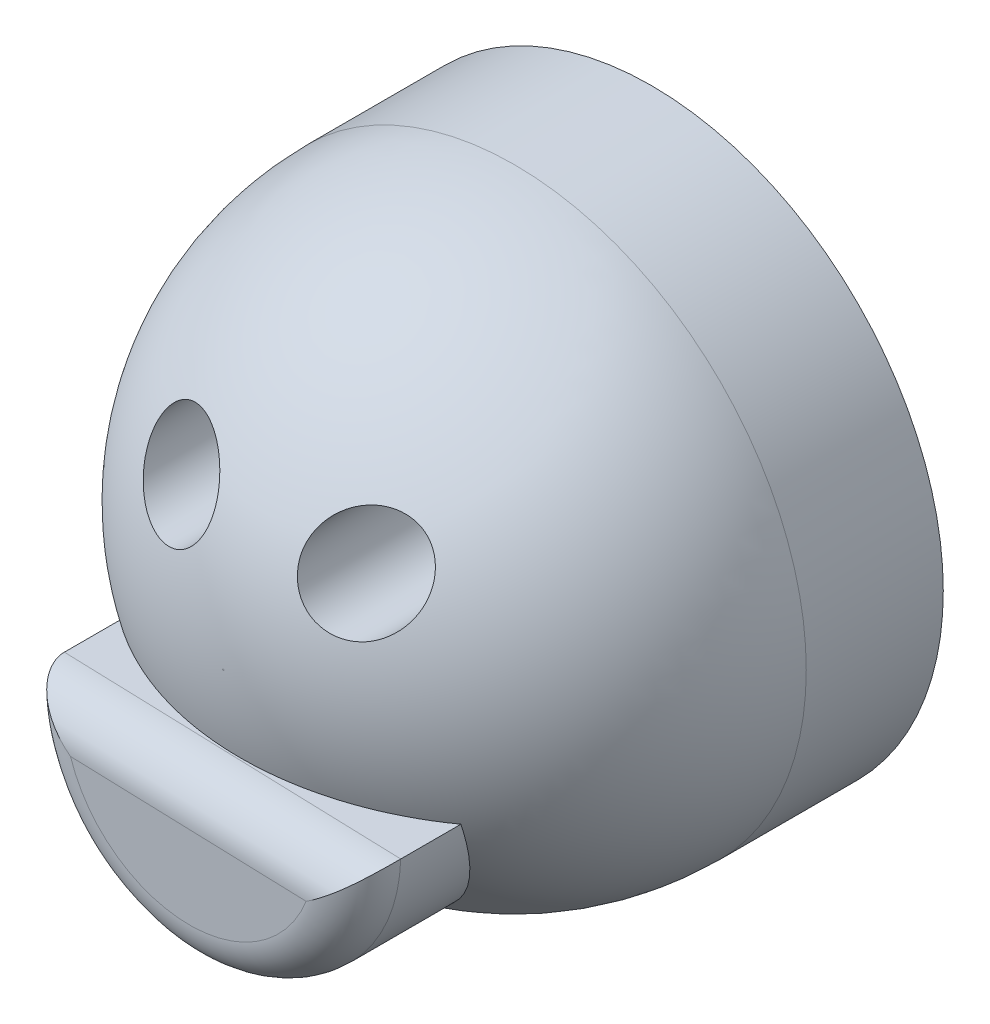
ISO-10303-21;
HEADER;
FILE_DESCRIPTION(('STEP AP214'),'2;1');
FILE_NAME('part.step','',(''),(''),'','','');
FILE_SCHEMA(('AUTOMOTIVE_DESIGN { 1 0 10303 214 1 1 1 1 }'));
ENDSEC;
DATA;
#1=APPLICATION_CONTEXT('core data for automotive mechanical design processes');
#2=APPLICATION_PROTOCOL_DEFINITION('international standard','automotive_design',2000,#1);
#3=PRODUCT_CONTEXT('',#1,'mechanical');
#4=PRODUCT('Part','Part','',(#3));
#5=PRODUCT_RELATED_PRODUCT_CATEGORY('part','',(#4));
#6=PRODUCT_DEFINITION_FORMATION('','',#4);
#7=PRODUCT_DEFINITION_CONTEXT('part definition',#1,'design');
#8=PRODUCT_DEFINITION('design','',#6,#7);
#9=PRODUCT_DEFINITION_SHAPE('','',#8);
#10=(LENGTH_UNIT() NAMED_UNIT(*) SI_UNIT(.MILLI.,.METRE.));
#11=(NAMED_UNIT(*) PLANE_ANGLE_UNIT() SI_UNIT($,.RADIAN.));
#12=(NAMED_UNIT(*) SI_UNIT($,.STERADIAN.) SOLID_ANGLE_UNIT());
#13=UNCERTAINTY_MEASURE_WITH_UNIT(LENGTH_MEASURE(1.E-05),#10,'distance_accuracy_value','');
#14=(GEOMETRIC_REPRESENTATION_CONTEXT(3) GLOBAL_UNCERTAINTY_ASSIGNED_CONTEXT((#13)) GLOBAL_UNIT_ASSIGNED_CONTEXT((#10,
#11,#12)) REPRESENTATION_CONTEXT('',''));
#15=CARTESIAN_POINT('',(0.,0.,0.));
#16=DIRECTION('',(0.,0.,1.));
#17=DIRECTION('',(1.,0.,0.));
#18=AXIS2_PLACEMENT_3D('',#15,#16,#17);
#19=CARTESIAN_POINT('',(-9.25737723848741,12.8505214496792,57.));
#20=DIRECTION('',(0.,0.,-1.));
#21=DIRECTION('',(-1.,0.,0.));
#22=AXIS2_PLACEMENT_3D('',#19,#20,#21);
#23=CYLINDRICAL_SURFACE('',#22,5.5);
#24=CARTESIAN_POINT('',(-12.9072072028845,16.9649766057103,42.5477959091102));
#25=CARTESIAN_POINT('',(-13.0140604511853,16.8701891517838,42.5563873106308));
#26=CARTESIAN_POINT('',(-13.1170758880721,16.7713597964741,42.5682582121675));
#27=CARTESIAN_POINT('',(-13.3147178261177,16.5664684033086,42.5983704048194));
#28=CARTESIAN_POINT('',(-13.4093404121222,16.4604030303369,42.6166146496213));
#29=CARTESIAN_POINT('',(-13.5897015599936,16.2418444617009,42.6592190220472));
#30=CARTESIAN_POINT('',(-13.6754258679522,16.1293413875084,42.6835887546428));
#31=CARTESIAN_POINT('',(-13.8374136016537,15.898981059377,42.7380789757917));
#32=CARTESIAN_POINT('',(-13.9136730116155,15.7811215615834,42.7682018916464));
#33=CARTESIAN_POINT('',(-14.0560204152741,15.5416764065529,42.8336078836441));
#34=CARTESIAN_POINT('',(-14.1221600944632,15.4201137656634,42.8688628121162));
#35=CARTESIAN_POINT('',(-14.2446054670298,15.1735641710642,42.9442145829014));
#36=CARTESIAN_POINT('',(-14.3009074657991,15.0485759511539,42.9843132347869));
#37=CARTESIAN_POINT('',(-14.454857651207,14.6699422650967,43.1111506170001));
#38=CARTESIAN_POINT('',(-14.5377154121831,14.4123463553259,43.2045085848092));
#39=CARTESIAN_POINT('',(-14.6691007064146,13.8733152917599,43.4128768338721));
#40=CARTESIAN_POINT('',(-14.7145081868092,13.5915669035247,43.5289985520606));
#41=CARTESIAN_POINT('',(-14.7616881300874,13.0296894637786,43.7734021902099));
#42=CARTESIAN_POINT('',(-14.7634390483365,12.7495612800146,43.9016900828656));
#43=CARTESIAN_POINT('',(-14.7227768183386,12.1587353695515,44.1848382866665));
#44=CARTESIAN_POINT('',(-14.6743397812629,11.8490463305635,44.340942380525));
#45=CARTESIAN_POINT('',(-14.5271092923104,11.2453591427245,44.6596744689687));
#46=CARTESIAN_POINT('',(-14.4282896900209,10.9513692299288,44.8223058110116));
#47=CARTESIAN_POINT('',(-14.1710647026199,10.3562882313705,45.1668199242544));
#48=CARTESIAN_POINT('',(-14.0076098553691,10.0575312709706,45.3489743842794));
#49=CARTESIAN_POINT('',(-13.6277670948659,9.49418275185944,45.7115846485517));
#50=CARTESIAN_POINT('',(-13.4113626307013,9.22960191545685,45.8920399033129));
#51=CARTESIAN_POINT('',(-13.0475652668029,8.8610915053749,46.1602677255554));
#52=CARTESIAN_POINT('',(-12.9175600985739,8.7414511789301,46.2505703404357));
#53=CARTESIAN_POINT('',(-12.6456794842515,8.51454241653131,46.4287643814814));
#54=CARTESIAN_POINT('',(-12.5038090474399,8.40726880463527,46.5166568045789));
#55=CARTESIAN_POINT('',(-12.2089926362081,8.20618856060068,46.6893998287366));
#56=CARTESIAN_POINT('',(-12.0560421432269,8.11238746973621,46.7742491674661));
#57=CARTESIAN_POINT('',(-11.7401840827872,7.93950747853151,46.9401333329919));
#58=CARTESIAN_POINT('',(-11.5772818564354,7.86042077158814,47.021170165335));
#59=CARTESIAN_POINT('',(-11.2514307253294,7.72183480327307,47.1745912012373));
#60=CARTESIAN_POINT('',(-11.0889361714544,7.66152328058421,47.2472063320046));
#61=CARTESIAN_POINT('',(-10.7572046364165,7.55611057745018,47.3877233113489));
#62=CARTESIAN_POINT('',(-10.5879711922357,7.51100153246962,47.455627582461));
#63=CARTESIAN_POINT('',(-10.2440510656069,7.4368897342342,47.5860801427284));
#64=CARTESIAN_POINT('',(-10.0693661430575,7.40788183871743,47.6486301364878));
#65=CARTESIAN_POINT('',(-9.71600008185808,7.36679177396061,47.767722236032));
#66=CARTESIAN_POINT('',(-9.5373194733823,7.3547073725788,47.8242651332197));
#67=CARTESIAN_POINT('',(-9.1969369148355,7.34850898638994,47.9249739543726));
#68=CARTESIAN_POINT('',(-9.03546653496261,7.35260866186317,47.969816887475));
#69=CARTESIAN_POINT('',(-8.71203824333144,7.3752246841211,48.0537200011101));
#70=CARTESIAN_POINT('',(-8.55008040206013,7.39373903773683,48.0927809802457));
#71=CARTESIAN_POINT('',(-8.22721404795284,7.44538724144292,48.1646673681743));
#72=CARTESIAN_POINT('',(-8.06630494636016,7.47851201291305,48.1974966311393));
#73=CARTESIAN_POINT('',(-7.7469777311678,7.5594145446557,48.2565563997379));
#74=CARTESIAN_POINT('',(-7.58855936545461,7.60719081172706,48.2827875773171));
#75=CARTESIAN_POINT('',(-7.29263845514121,7.71129064321229,48.3258719717466));
#76=CARTESIAN_POINT('',(-7.15471886997797,7.76614227416268,48.3434303807959));
#77=CARTESIAN_POINT('',(-6.8832740520946,7.88708464451781,48.3728466584016));
#78=CARTESIAN_POINT('',(-6.74974841780397,7.95317435343207,48.3847050492476));
#79=CARTESIAN_POINT('',(-6.48825395870084,8.09613879049406,48.4025905867804));
#80=CARTESIAN_POINT('',(-6.36028319951789,8.17300972420271,48.4086197791789));
#81=CARTESIAN_POINT('',(-6.11092047162358,8.3369780856974,48.4147875037095));
#82=CARTESIAN_POINT('',(-5.98952832037686,8.42407522952623,48.4149261993678));
#83=CARTESIAN_POINT('',(-5.76145008403218,8.60221035308469,48.4094826996638));
#84=CARTESIAN_POINT('',(-5.65431860697311,8.69268974604557,48.4042466494968));
#85=CARTESIAN_POINT('',(-5.44744299149838,8.88138960075264,48.3886249502624));
#86=CARTESIAN_POINT('',(-5.34770126491339,8.97961256840795,48.3782376283838));
#87=CARTESIAN_POINT('',(-5.15633597562459,9.18296832857103,48.3524177139507));
#88=CARTESIAN_POINT('',(-5.06470888440285,9.28809808279061,48.3369873281177));
#89=CARTESIAN_POINT('',(-4.89003323300438,9.50453049711651,48.3012184059297));
#90=CARTESIAN_POINT('',(-4.80698791151042,9.6158354635144,48.2808780261777));
#91=CARTESIAN_POINT('',(-4.64964251986597,9.84418276024531,48.2353847089241));
#92=CARTESIAN_POINT('',(-4.57537745670499,9.96124558514763,48.2102134915766));
#93=CARTESIAN_POINT('',(-4.43627736998531,10.1998427063166,48.1553295851225));
#94=CARTESIAN_POINT('',(-4.37144573358963,10.3213785891491,48.1256152725886));
#95=CARTESIAN_POINT('',(-4.1915175475601,10.6913293966694,48.0300235297009));
#96=CARTESIAN_POINT('',(-4.09086256834381,10.9452705643238,47.9576606481871));
#97=CARTESIAN_POINT('',(-3.92411004236922,11.4763117123146,47.7930568792736));
#98=CARTESIAN_POINT('',(-3.86047774171968,11.7538823209946,47.6998767889795));
#99=CARTESIAN_POINT('',(-3.77672643829429,12.3104261583527,47.4992830972338));
#100=CARTESIAN_POINT('',(-3.7566231049492,12.5893998559013,47.3918643849661));
#101=CARTESIAN_POINT('',(-3.75824936294008,13.169133259573,47.1545399321331));
#102=CARTESIAN_POINT('',(-3.78419991409371,13.4693996326367,47.0234646237229));
#103=CARTESIAN_POINT('',(-3.88307888847881,14.0570943266708,46.7507596073395));
#104=CARTESIAN_POINT('',(-3.9560275044973,14.3445170725682,46.6091253858552));
#105=CARTESIAN_POINT('',(-4.15520750784627,14.9297197048802,46.3032603356111));
#106=CARTESIAN_POINT('',(-4.28620142466807,15.2254547996055,46.1382132113792));
#107=CARTESIAN_POINT('',(-4.59613429052784,15.7875094903289,45.8030548950285));
#108=CARTESIAN_POINT('',(-4.77509370739228,16.0538164600907,45.6329415686714));
#109=CARTESIAN_POINT('',(-5.1914264413742,16.5702532918545,45.2784374132687));
#110=CARTESIAN_POINT('',(-5.43223969583345,16.8175527982918,45.0939570252271));
#111=CARTESIAN_POINT('',(-5.95771684512472,17.2642570289073,44.7286772221704));
#112=CARTESIAN_POINT('',(-6.24239470674187,17.4636464462555,44.5478790004139));
#113=CARTESIAN_POINT('',(-6.69854147585041,17.7222240999347,44.2829925535192));
#114=CARTESIAN_POINT('',(-6.85651916279371,17.8020321691597,44.1952239604207));
#115=CARTESIAN_POINT('',(-7.1809083446437,17.9465747755711,44.0229848076844));
#116=CARTESIAN_POINT('',(-7.34731582070793,18.011316414735,43.9385127098454));
#117=CARTESIAN_POINT('',(-7.68756804514196,18.1247876030159,43.773725358126));
#118=CARTESIAN_POINT('',(-7.86141535361511,18.1735115894429,43.6934115565001));
#119=CARTESIAN_POINT('',(-8.21517441088773,18.2539171346284,43.5379959625934));
#120=CARTESIAN_POINT('',(-8.3950823524512,18.2856091881081,43.4628909856519));
#121=CARTESIAN_POINT('',(-8.74524975668017,18.3292401892542,43.3245894771292));
#122=CARTESIAN_POINT('',(-8.91515324490112,18.3425382183777,43.2609209233383));
#123=CARTESIAN_POINT('',(-9.25756845583482,18.3531858314086,43.1397981421652));
#124=CARTESIAN_POINT('',(-9.4300785517468,18.3505449835324,43.0823402075913));
#125=CARTESIAN_POINT('',(-9.77621599596526,18.3287387738394,42.9745460268087));
#126=CARTESIAN_POINT('',(-9.94984283936479,18.3095804212292,42.9242067703331));
#127=CARTESIAN_POINT('',(-10.2965354313587,18.2543110476827,42.8315561815373));
#128=CARTESIAN_POINT('',(-10.4696012997145,18.2182039231522,42.7892430072138));
#129=CARTESIAN_POINT('',(-10.7886763589346,18.1352434155688,42.7189292919516));
#130=CARTESIAN_POINT('',(-10.9350190250191,18.0906619117056,42.689747642346));
#131=CARTESIAN_POINT('',(-11.2245450294945,17.9889822010971,42.6384146762699));
#132=CARTESIAN_POINT('',(-11.3677289611456,17.9318863671522,42.6162620289998));
#133=CARTESIAN_POINT('',(-11.6492522764025,17.805587885541,42.57942834047));
#134=CARTESIAN_POINT('',(-11.7876020438642,17.7364133821503,42.5647302337492));
#135=CARTESIAN_POINT('',(-12.0583666567901,17.5863837708901,42.5430169016915));
#136=CARTESIAN_POINT('',(-12.1907847519212,17.5055351638104,42.5359974190042));
#137=CARTESIAN_POINT('',(-12.4225361921581,17.3502033310563,42.53038950624));
#138=CARTESIAN_POINT('',(-12.5231730645919,17.277702724159,42.5303909531178));
#139=CARTESIAN_POINT('',(-12.7192350326404,17.1261372408744,42.5353738215406));
#140=CARTESIAN_POINT('',(-12.8146605769501,17.0470729311035,42.5403548136319));
#141=CARTESIAN_POINT('',(-12.9072072028845,16.9649766057103,42.5477959091102));
#142=B_SPLINE_CURVE_WITH_KNOTS('',3,(#24,#25,#26,#27,#28,#29,#30,#31,#32,#33,#34,#35,#36,#37,
#38,#39,#40,#41,#42,#43,#44,#45,#46,#47,#48,#49,#50,#51,#52,#53,#54,#55,#56,#57,#58,#59,#60,#61,
#62,#63,#64,#65,#66,#67,#68,#69,#70,#71,#72,#73,#74,#75,#76,#77,#78,#79,#80,#81,#82,#83,#84,#85,
#86,#87,#88,#89,#90,#91,#92,#93,#94,#95,#96,#97,#98,#99,#100,#101,#102,#103,#104,#105,#106,#107,
#108,#109,#110,#111,#112,#113,#114,#115,#116,#117,#118,#119,#120,#121,#122,#123,#124,#125,#126,
#127,#128,#129,#130,#131,#132,#133,#134,#135,#136,#137,#138,#139,#140,#141),.UNSPECIFIED.,.T.,
.F.,(4,2,2,2,2,2,2,2,2,2,2,2,2,2,2,2,2,2,2,2,2,2,2,2,2,2,2,2,2,2,2,2,2,2,2,2,2,2,2,2,2,2,2,2,2,
2,2,2,2,2,2,2,2,2,2,2,2,2,4),(0.,0.429156608893507,0.858512372219872,1.28854562621691,
1.71876071613443,2.14669938242189,2.57479842017683,3.43000107390439,4.35078834099497,
5.27203001016448,6.31825492510995,7.36502342309644,8.51855783251592,9.67245327366315,
10.2670814082643,10.8614597577343,11.4560818803659,12.0503876255696,12.6133919588368,
13.1761045904025,13.7386374035564,14.3010960138731,14.8033035638609,15.3054416841494,
15.8072682245018,16.3090436383955,16.7568519487563,17.2046192188607,17.6522292914413,
18.099826937907,18.5203026356711,18.9409149671652,19.3613434948465,19.7819301134367,
20.2041407778558,20.6265026689676,21.4705598384495,22.3657925837612,23.2613475388077,
24.2432623299694,25.2255992838539,26.3103606225963,27.3955855894336,28.5644825907183,
29.7337525486915,30.3257874485861,30.9175427086477,31.5095032598426,32.1010986378842,
32.6461032899422,33.1907808045525,33.7352272988403,34.2795486898858,34.7461145519053,
35.2125920263344,35.6779967320365,36.1431432669055,36.5148719894116,36.8865686554668),.UNSPECIFIED.);
#143=CARTESIAN_POINT('',(-12.9072072028845,16.9649766057103,42.5477959091102));
#144=VERTEX_POINT('',#143);
#145=EDGE_CURVE('E138',#144,#144,#142,.T.);
#146=ORIENTED_EDGE('',*,*,#145,.T.);
#147=EDGE_LOOP('',(#146));
#148=FACE_BOUND('',#147,.T.);
#149=CARTESIAN_POINT('',(-9.25737723848741,12.8505214496792,27.));
#150=DIRECTION('',(0.,0.,-1.));
#151=DIRECTION('',(-1.,0.,0.));
#152=AXIS2_PLACEMENT_3D('',#149,#150,#151);
#153=CIRCLE('',#152,5.5);
#154=CARTESIAN_POINT('',(-14.7573772384874,12.8505214496792,27.));
#155=VERTEX_POINT('',#154);
#156=EDGE_CURVE('E150',#155,#155,#153,.F.);
#157=ORIENTED_EDGE('',*,*,#156,.F.);
#158=EDGE_LOOP('',(#157));
#159=FACE_BOUND('',#158,.T.);
#160=ADVANCED_FACE('F36',(#148,#159),#23,.F.);
#161=CARTESIAN_POINT('',(11.4272316677599,12.8505214496792,57.));
#162=DIRECTION('',(0.,0.,-1.));
#163=DIRECTION('',(-1.,0.,0.));
#164=AXIS2_PLACEMENT_3D('',#161,#162,#163);
#165=CYLINDRICAL_SURFACE('',#164,5.5);
#166=CARTESIAN_POINT('',(15.2593620584543,16.7957434546768,41.386080964578));
#167=CARTESIAN_POINT('',(15.1630712113056,16.8892793943901,41.382089837552));
#168=CARTESIAN_POINT('',(15.0633025691665,16.9793259389152,41.3814197342294));
#169=CARTESIAN_POINT('',(14.8575140852864,17.1518208012796,41.3867183957662));
#170=CARTESIAN_POINT('',(14.7514931774445,17.2342678171115,41.3926882959592));
#171=CARTESIAN_POINT('',(14.5340448845873,17.3909712852645,41.4111731465244));
#172=CARTESIAN_POINT('',(14.4226152160776,17.4652242341032,41.4236908834822));
#173=CARTESIAN_POINT('',(14.19525640845,17.6050835723007,41.4550659515435));
#174=CARTESIAN_POINT('',(14.0793254992107,17.6706865145213,41.4739257994933));
#175=CARTESIAN_POINT('',(13.8443878752612,17.7926667853016,41.5175981907555));
#176=CARTESIAN_POINT('',(13.725395090283,17.8490794692541,41.5423869702517));
#177=CARTESIAN_POINT('',(13.4847739830331,17.9528459433099,41.5975866612467));
#178=CARTESIAN_POINT('',(13.3631446679101,18.0001962523783,41.6279997243579));
#179=CARTESIAN_POINT('',(12.9956702697736,18.1285118417737,41.7270505717172));
#180=CARTESIAN_POINT('',(12.7470363036936,18.1958457030698,41.8035384260418));
#181=CARTESIAN_POINT('',(12.2345506153206,18.2975820664919,41.9786524077705));
#182=CARTESIAN_POINT('',(11.9706430101019,18.3298772691214,42.07829568162));
#183=CARTESIAN_POINT('',(11.447182403148,18.3567299396451,42.2928115947896));
#184=CARTESIAN_POINT('',(11.1876312073753,18.3512721262253,42.4076903825436));
#185=CARTESIAN_POINT('',(10.6367761056727,18.3015118244145,42.6681578078188));
#186=CARTESIAN_POINT('',(10.3469565436511,18.2511920377892,42.8157283222068));
#187=CARTESIAN_POINT('',(9.78418179372839,18.107406916347,43.1215961196392));
#188=CARTESIAN_POINT('',(9.51123725229884,18.013914652658,43.279900045002));
#189=CARTESIAN_POINT('',(8.94593858044634,17.7700746492881,43.6281860196268));
#190=CARTESIAN_POINT('',(8.65709375042506,17.613177514163,43.819285487885));
#191=CARTESIAN_POINT('',(8.11319627953188,17.2520803083736,44.2053102796269));
#192=CARTESIAN_POINT('',(7.85816140467886,17.047855522253,44.4002375532183));
#193=CARTESIAN_POINT('',(7.49458851592821,16.6996781528609,44.7007831322127));
#194=CARTESIAN_POINT('',(7.37205462480495,16.5703778400781,44.8068248046676));
#195=CARTESIAN_POINT('',(7.139753319713,16.3000514378295,45.0179034409505));
#196=CARTESIAN_POINT('',(7.02998170408291,16.159029233876,45.1229407249367));
#197=CARTESIAN_POINT('',(6.82409641722177,15.8660207831036,45.3313676505475));
#198=CARTESIAN_POINT('',(6.72799212983496,15.7140271103047,45.4347561172808));
#199=CARTESIAN_POINT('',(6.55057237787206,15.4001629005672,45.6390380486835));
#200=CARTESIAN_POINT('',(6.46925008824909,15.2382969681251,45.7399326461183));
#201=CARTESIAN_POINT('',(6.3228857735391,14.9067944612122,45.9378381016312));
#202=CARTESIAN_POINT('',(6.25773697252118,14.7372181004085,46.034870675701));
#203=CARTESIAN_POINT('',(6.14408065667565,14.3905138348796,46.2249422679488));
#204=CARTESIAN_POINT('',(6.09556523838111,14.2133895617044,46.3179831643627));
#205=CARTESIAN_POINT('',(6.01618725247276,13.8528517885503,46.4992798181458));
#206=CARTESIAN_POINT('',(5.98532274578265,13.6694389817582,46.5875361001738));
#207=CARTESIAN_POINT('',(5.94226341190129,13.2978405241342,46.7583864834211));
#208=CARTESIAN_POINT('',(5.93006596866072,13.1096555458448,46.8409813764918));
#209=CARTESIAN_POINT('',(5.92551087050219,12.7490122610575,46.991749221165));
#210=CARTESIAN_POINT('',(5.93131346194215,12.5768354514235,47.0605409623662));
#211=CARTESIAN_POINT('',(5.95943178269011,12.2315229417678,47.192059572055));
#212=CARTESIAN_POINT('',(5.98174452482413,12.0583874208288,47.2547875353381));
#213=CARTESIAN_POINT('',(6.04330551271311,11.7129384934886,47.3734143328792));
#214=CARTESIAN_POINT('',(6.08253944463368,11.5406245164169,47.4293188879717));
#215=CARTESIAN_POINT('',(6.17819320235755,11.1985152609017,47.5336356835453));
#216=CARTESIAN_POINT('',(6.23461000406013,11.0287195447667,47.5820492401462));
#217=CARTESIAN_POINT('',(6.35561921804147,10.716806688413,47.6645677407794));
#218=CARTESIAN_POINT('',(6.41800324571157,10.574108146075,47.6997255117378));
#219=CARTESIAN_POINT('',(6.55532587005777,10.2933867257638,47.7635658111889));
#220=CARTESIAN_POINT('',(6.63026250766795,10.155363122215,47.7922493484677));
#221=CARTESIAN_POINT('',(6.79225914823926,9.88542570506671,47.8427751115188));
#222=CARTESIAN_POINT('',(6.87931130769202,9.75350801158735,47.8646217339737));
#223=CARTESIAN_POINT('',(7.0649859807424,9.49703560363109,47.9012134109504));
#224=CARTESIAN_POINT('',(7.16360747727383,9.37248024337338,47.9159590891387));
#225=CARTESIAN_POINT('',(7.36025674651174,9.14514998368258,47.9369399299893));
#226=CARTESIAN_POINT('',(7.45717448447346,9.04148163666993,47.9439283118399));
#227=CARTESIAN_POINT('',(7.65886060852433,8.84184239233224,47.9520378884992));
#228=CARTESIAN_POINT('',(7.76362846785999,8.74587097942587,47.9531594766204));
#229=CARTESIAN_POINT('',(7.98018785003957,8.5623953238768,47.9495237270903));
#230=CARTESIAN_POINT('',(8.09197754184119,8.47488888886485,47.944767916063));
#231=CARTESIAN_POINT('',(8.32172076220291,8.30894896578811,47.9294326147258));
#232=CARTESIAN_POINT('',(8.43967428557736,8.23051547009041,47.9188531293154));
#233=CARTESIAN_POINT('',(8.67630676835222,8.08597371043681,47.8924861954577));
#234=CARTESIAN_POINT('',(8.79479562656146,8.01951556504512,47.8769070517148));
#235=CARTESIAN_POINT('',(9.03576947190353,7.89580066197374,47.8406043579031));
#236=CARTESIAN_POINT('',(9.15825575295167,7.83854691990273,47.8198791274745));
#237=CARTESIAN_POINT('',(9.40626192667091,7.73350954092234,47.7734890202349));
#238=CARTESIAN_POINT('',(9.53178084570937,7.68572290874588,47.7478257108478));
#239=CARTESIAN_POINT('',(9.78506208074046,7.59969510073901,47.6917752811693));
#240=CARTESIAN_POINT('',(9.91282522914106,7.56145755034892,47.6613863738233));
#241=CARTESIAN_POINT('',(10.1745240047296,7.49331352674913,47.5949225376464));
#242=CARTESIAN_POINT('',(10.3085116960981,7.46377237391191,47.5586773812868));
#243=CARTESIAN_POINT('',(10.5770739725136,7.41490845652201,47.481688111214));
#244=CARTESIAN_POINT('',(10.7116487526721,7.39558939937597,47.4409423716715));
#245=CARTESIAN_POINT('',(11.1149362634672,7.35275491226462,47.3124369397168));
#246=CARTESIAN_POINT('',(11.3833831206706,7.34431853120388,47.2183653876275));
#247=CARTESIAN_POINT('',(11.9380129544381,7.36661023775826,47.0066403208464));
#248=CARTESIAN_POINT('',(12.2234995194015,7.40108386291314,46.8876028386535));
#249=CARTESIAN_POINT('',(12.7799470204244,7.51191606136265,46.6359008865442));
#250=CARTESIAN_POINT('',(13.0509013854064,7.58829341002629,46.5032303298684));
#251=CARTESIAN_POINT('',(13.6054493533355,7.79059792616674,46.2103592555308));
#252=CARTESIAN_POINT('',(13.8865134567931,7.92145556666814,46.048778302251));
#253=CARTESIAN_POINT('',(14.4188018066871,8.22510077601109,45.7161896832524));
#254=CARTESIAN_POINT('',(14.6700111115327,8.39790920965325,45.5451773595237));
#255=CARTESIAN_POINT('',(15.1658488028618,8.8024658822429,45.1768743325006));
#256=CARTESIAN_POINT('',(15.406243012369,9.03875165854647,44.9788554041236));
#257=CARTESIAN_POINT('',(15.8394443675669,9.54981213036256,44.5803046051688));
#258=CARTESIAN_POINT('',(16.0322306324498,9.82460363192847,44.3797716723244));
#259=CARTESIAN_POINT('',(16.3769163724496,10.4258836597629,43.9674364641364));
#260=CARTESIAN_POINT('',(16.525103090299,10.7546255852136,43.7558049756787));
#261=CARTESIAN_POINT('',(16.7557317643588,11.4405969021131,43.3417134510372));
#262=CARTESIAN_POINT('',(16.8381384167819,11.7978414777988,43.1392583946933));
#263=CARTESIAN_POINT('',(16.9066813644508,12.3425113211808,42.8514842659066));
#264=CARTESIAN_POINT('',(16.9205099756302,12.5231633774694,42.7592967002141));
#265=CARTESIAN_POINT('',(16.9301238794022,12.8876487535769,42.5801897421263));
#266=CARTESIAN_POINT('',(16.9259074097467,13.0714823823561,42.4932708651019));
#267=CARTESIAN_POINT('',(16.8986284139446,13.4404302039809,42.3261358103758));
#268=CARTESIAN_POINT('',(16.8755974898643,13.6255417337913,42.2459086416645));
#269=CARTESIAN_POINT('',(16.8099976975219,13.995548780046,42.0933894276284));
#270=CARTESIAN_POINT('',(16.7674381034937,14.1804443573073,42.0210936358361));
#271=CARTESIAN_POINT('',(16.6779827179335,14.4929500014459,41.9061405062903));
#272=CARTESIAN_POINT('',(16.6361887439567,14.6211578275393,41.8610847804892));
#273=CARTESIAN_POINT('',(16.5426343305105,14.8756189909872,41.7761283781066));
#274=CARTESIAN_POINT('',(16.490876210205,15.0018727757732,41.7362265055652));
#275=CARTESIAN_POINT('',(16.3774581476043,15.251355005992,41.6621576845587));
#276=CARTESIAN_POINT('',(16.3158131475569,15.3745876982722,41.6279822385293));
#277=CARTESIAN_POINT('',(16.182710097641,15.6172120897883,41.5658060196465));
#278=CARTESIAN_POINT('',(16.1112539761236,15.7366045381367,41.5378040362258));
#279=CARTESIAN_POINT('',(15.9247529173759,16.0227466511824,41.4774142805398));
#280=CARTESIAN_POINT('',(15.8044712558751,16.1868975810292,41.4486303831421));
#281=CARTESIAN_POINT('',(15.545284317651,16.5019926110259,41.4060095386949));
#282=CARTESIAN_POINT('',(15.4063766376495,16.652935002744,41.39217452256));
#283=CARTESIAN_POINT('',(15.2593620584543,16.7957434546768,41.386080964578));
#284=B_SPLINE_CURVE_WITH_KNOTS('',3,(#166,#167,#168,#169,#170,#171,#172,#173,#174,#175,#176,
#177,#178,#179,#180,#181,#182,#183,#184,#185,#186,#187,#188,#189,#190,#191,#192,#193,#194,#195,
#196,#197,#198,#199,#200,#201,#202,#203,#204,#205,#206,#207,#208,#209,#210,#211,#212,#213,#214,
#215,#216,#217,#218,#219,#220,#221,#222,#223,#224,#225,#226,#227,#228,#229,#230,#231,#232,#233,
#234,#235,#236,#237,#238,#239,#240,#241,#242,#243,#244,#245,#246,#247,#248,#249,#250,#251,#252,
#253,#254,#255,#256,#257,#258,#259,#260,#261,#262,#263,#264,#265,#266,#267,#268,#269,#270,#271,
#272,#273,#274,#275,#276,#277,#278,#279,#280,#281,#282,#283),.UNSPECIFIED.,.T.,.F.,(4,2,2,2,2,2,
2,2,2,2,2,2,2,2,2,2,2,2,2,2,2,2,2,2,2,2,2,2,2,2,2,2,2,2,2,2,2,2,2,2,2,2,2,2,2,2,2,2,2,2,2,2,2,2,
2,2,2,2,4),(0.,0.402711219229724,0.805491306174313,1.2084429452698,1.61155468351012,
2.01307701033094,2.4147532615197,3.21742152959585,4.06606799774158,4.91505799319154,
5.89855639810539,6.88266909141351,8.01871843505678,9.15536238888427,9.77668036985063,
10.3977932146025,11.0193304710949,11.6405800224867,12.2576120170403,12.8743504169149,
13.4910210507341,14.1076052548605,14.6633187945291,15.2189318137795,15.7740757524217,
16.3291220448583,16.807437656108,17.2856786868315,17.7636115353482,18.241502399991,
18.6672339750489,19.0929370084953,19.5185294910191,19.9441216154963,20.3538868126829,
20.7637859875135,21.1735552678812,21.583479887082,22.0087449509071,22.434164146696,
23.2844631765511,24.2144719124147,25.144897688407,26.1895046294941,27.2346321884285,
28.402445282393,29.5707696721768,30.8192528963423,32.0684057246941,32.6775389879102,
33.2867317392755,33.8949033469031,34.5027864301453,34.9289038139637,35.3549221382322,
35.7803025762466,36.205599526176,36.8203700550478,37.4352199830046),.UNSPECIFIED.);
#285=CARTESIAN_POINT('',(15.2593620584543,16.7957434546768,41.386080964578));
#286=VERTEX_POINT('',#285);
#287=EDGE_CURVE('E105',#286,#286,#284,.T.);
#288=ORIENTED_EDGE('',*,*,#287,.T.);
#289=EDGE_LOOP('',(#288));
#290=FACE_BOUND('',#289,.T.);
#291=CARTESIAN_POINT('',(11.4272316677599,12.8505214496792,27.));
#292=DIRECTION('',(0.,0.,-1.));
#293=DIRECTION('',(-1.,0.,0.));
#294=AXIS2_PLACEMENT_3D('',#291,#292,#293);
#295=CIRCLE('',#294,5.5);
#296=CARTESIAN_POINT('',(5.92723166775994,12.8505214496792,27.));
#297=VERTEX_POINT('',#296);
#298=EDGE_CURVE('E41',#297,#297,#295,.F.);
#299=ORIENTED_EDGE('',*,*,#298,.F.);
#300=EDGE_LOOP('',(#299));
#301=FACE_BOUND('',#300,.T.);
#302=ADVANCED_FACE('F126',(#290,#301),#165,.F.);
#303=CARTESIAN_POINT('',(0.,0.,50.));
#304=DIRECTION('',(0.,0.,-1.));
#305=DIRECTION('',(-1.,0.,0.));
#306=AXIS2_PLACEMENT_3D('',#303,#304,#305);
#307=CYLINDRICAL_SURFACE('',#306,34.075);
#308=CARTESIAN_POINT('',(0.,0.,16.));
#309=DIRECTION('',(0.,0.,1.));
#310=DIRECTION('',(1.,0.,0.));
#311=AXIS2_PLACEMENT_3D('',#308,#309,#310);
#312=CIRCLE('',#311,34.075);
#313=CARTESIAN_POINT('',(34.075,0.,16.));
#314=VERTEX_POINT('',#313);
#315=EDGE_CURVE('E93',#314,#314,#312,.F.);
#316=ORIENTED_EDGE('',*,*,#315,.T.);
#317=EDGE_LOOP('',(#316));
#318=FACE_BOUND('',#317,.T.);
#319=CARTESIAN_POINT('',(0.,0.,0.));
#320=DIRECTION('',(0.,0.,1.));
#321=DIRECTION('',(1.,0.,0.));
#322=AXIS2_PLACEMENT_3D('',#319,#320,#321);
#323=CIRCLE('',#322,34.075);
#324=CARTESIAN_POINT('',(34.075,0.,0.));
#325=VERTEX_POINT('',#324);
#326=EDGE_CURVE('E146',#325,#325,#323,.T.);
#327=ORIENTED_EDGE('',*,*,#326,.T.);
#328=EDGE_LOOP('',(#327));
#329=FACE_BOUND('',#328,.T.);
#330=ADVANCED_FACE('F130',(#318,#329),#307,.T.);
#331=CARTESIAN_POINT('',(0.,0.,50.));
#332=DIRECTION('',(0.,0.,1.));
#333=DIRECTION('',(1.,0.,0.));
#334=AXIS2_PLACEMENT_3D('',#331,#332,#333);
#335=PLANE('',#334);
#336=CARTESIAN_POINT('',(0.,0.,50.));
#337=DIRECTION('',(0.,0.,1.));
#338=DIRECTION('',(1.,0.,0.));
#339=AXIS2_PLACEMENT_3D('',#336,#337,#338);
#340=CIRCLE('',#339,0.0749999999999987);
#341=CARTESIAN_POINT('',(0.0749999999999987,0.,50.));
#342=VERTEX_POINT('',#341);
#343=EDGE_CURVE('E96',#342,#342,#340,.T.);
#344=ORIENTED_EDGE('',*,*,#343,.T.);
#345=EDGE_LOOP('',(#344));
#346=FACE_BOUND('',#345,.T.);
#347=ADVANCED_FACE('F136',(#346),#335,.T.);
#348=CARTESIAN_POINT('',(0.,0.,0.));
#349=DIRECTION('',(0.,0.,1.));
#350=DIRECTION('',(1.,0.,0.));
#351=AXIS2_PLACEMENT_3D('',#348,#349,#350);
#352=PLANE('',#351);
#353=CARTESIAN_POINT('',(0.,0.,0.));
#354=DIRECTION('',(0.,0.,-1.));
#355=DIRECTION('',(-1.,0.,0.));
#356=AXIS2_PLACEMENT_3D('',#353,#354,#355);
#357=CIRCLE('',#356,28.2538998308258);
#358=CARTESIAN_POINT('',(-28.2538998308258,0.,0.));
#359=VERTEX_POINT('',#358);
#360=EDGE_CURVE('E154',#359,#359,#357,.T.);
#361=ORIENTED_EDGE('',*,*,#360,.F.);
#362=EDGE_LOOP('',(#361));
#363=FACE_BOUND('',#362,.T.);
#364=ORIENTED_EDGE('',*,*,#326,.F.);
#365=EDGE_LOOP('',(#364));
#366=FACE_BOUND('',#365,.T.);
#367=ADVANCED_FACE('F216',(#363,#366),#352,.F.);
#368=CARTESIAN_POINT('',(0.,0.,16.));
#369=DIRECTION('',(0.,0.,1.));
#370=DIRECTION('',(1.,0.,0.));
#371=AXIS2_PLACEMENT_3D('',#368,#369,#370);
#372=DEGENERATE_TOROIDAL_SURFACE('',#371,0.0749999999999987,34.,.T.);
#373=CARTESIAN_POINT('',(-19.5558562940161,-8.50149505844834,42.5421555290233));
#374=CARTESIAN_POINT('',(-19.574931873684,-9.08816209578544,42.3409494195911));
#375=CARTESIAN_POINT('',(-19.5676115857604,-9.67478268908394,42.1373389097922));
#376=CARTESIAN_POINT('',(-19.5008178309394,-10.8437285295561,41.7265662863757));
#377=CARTESIAN_POINT('',(-19.4413501389267,-11.4260542451506,41.519404568515));
#378=CARTESIAN_POINT('',(-19.2709263680775,-12.5821883896211,41.102796118108));
#379=CARTESIAN_POINT('',(-19.1599837620751,-13.1559990066728,40.8933499974708));
#380=CARTESIAN_POINT('',(-18.9557404966956,-14.0071879976817,40.5785349779164));
#381=CARTESIAN_POINT('',(-18.8813496539943,-14.2893442913026,40.4734835081888));
#382=CARTESIAN_POINT('',(-18.7200674985225,-14.8501210308587,40.263296339725));
#383=CARTESIAN_POINT('',(-18.6331729427075,-15.1287405390052,40.1581606261958));
#384=CARTESIAN_POINT('',(-18.3537696520801,-15.9590493398021,39.8427150329233));
#385=CARTESIAN_POINT('',(-18.142668817213,-16.5046576533163,39.6325631875182));
#386=CARTESIAN_POINT('',(-17.6723277971972,-17.5755528553049,39.214361448887));
#387=CARTESIAN_POINT('',(-17.4130881685367,-18.1008399786091,39.0063115313918));
#388=CARTESIAN_POINT('',(-16.9893542364779,-18.8706298701247,38.6971494252353));
#389=CARTESIAN_POINT('',(-16.8422685895343,-19.124245523876,38.5945632803377));
#390=CARTESIAN_POINT('',(-16.5367101919853,-19.6249249492383,38.3906132103358));
#391=CARTESIAN_POINT('',(-16.378240332294,-19.8719903625567,38.2892489825189));
#392=CARTESIAN_POINT('',(-15.8859929185334,-20.6028005344686,37.9872943045139));
#393=CARTESIAN_POINT('',(-15.5353472835205,-21.0762142069937,37.7888197556714));
#394=CARTESIAN_POINT('',(-14.7925633698025,-21.9898496557298,37.4004317835713));
#395=CARTESIAN_POINT('',(-14.4005779360391,-22.4301840609211,37.2104902864922));
#396=CARTESIAN_POINT('',(-13.5762243170333,-23.2759802047022,36.8406596505168));
#397=CARTESIAN_POINT('',(-13.1438555752054,-23.6814414625027,36.6607706502243));
#398=CARTESIAN_POINT('',(-12.2412845087989,-24.45381206615,36.3135527321629));
#399=CARTESIAN_POINT('',(-11.7710834412508,-24.8207226919606,36.1462233974389));
#400=CARTESIAN_POINT('',(-10.7957611202533,-25.5123706634685,35.8268036991123));
#401=CARTESIAN_POINT('',(-10.2906422435196,-25.8371108752144,35.674712300047));
#402=CARTESIAN_POINT('',(-9.27821152616721,-26.4238693243961,35.3966325006907));
#403=CARTESIAN_POINT('',(-8.77261983126842,-26.6883875369461,35.2696572523799));
#404=CARTESIAN_POINT('',(-7.73674468770226,-27.1737915967235,35.0341898807359));
#405=CARTESIAN_POINT('',(-7.2064619246765,-27.3946786546442,34.9256972445518));
#406=CARTESIAN_POINT('',(-6.12556265332924,-27.7899665112827,34.7295976369961));
#407=CARTESIAN_POINT('',(-5.57496238332576,-27.964403555626,34.6419743866078));
#408=CARTESIAN_POINT('',(-4.45757606305382,-28.2646527772376,34.4896026669221));
#409=CARTESIAN_POINT('',(-3.89079171266523,-28.3904700412118,34.4248518047272));
#410=CARTESIAN_POINT('',(-2.80140812114292,-28.5819369238844,34.3249670760794));
#411=CARTESIAN_POINT('',(-2.27982583799317,-28.6522226096048,34.2875774153156));
#412=CARTESIAN_POINT('',(-1.23164373310717,-28.7507267797358,34.2336706233698));
#413=CARTESIAN_POINT('',(-0.705044278684795,-28.7789483202612,34.2171519758453));
#414=CARTESIAN_POINT('',(0.34879707365127,-28.792938835966,34.2053725662195));
#415=CARTESIAN_POINT('',(0.876038737560213,-28.778720272338,34.2101055644512));
#416=CARTESIAN_POINT('',(1.92705567842638,-28.7080184118749,34.240704423384));
#417=CARTESIAN_POINT('',(2.45083102773632,-28.6515360000419,34.2665698415746));
#418=CARTESIAN_POINT('',(3.46007026760678,-28.5015716451789,34.3367001835289));
#419=CARTESIAN_POINT('',(3.9459721044149,-28.4104677419924,34.3797902593406));
#420=CARTESIAN_POINT('',(4.9077533319416,-28.1924358084004,34.4833038038705));
#421=CARTESIAN_POINT('',(5.38363322865541,-28.0655095913011,34.5437263952286));
#422=CARTESIAN_POINT('',(6.32243419768074,-27.777099354159,34.6808007556705));
#423=CARTESIAN_POINT('',(6.7853540035758,-27.6156119701515,34.7574541045456));
#424=CARTESIAN_POINT('',(7.69550783016167,-27.25960424416,34.9256840601386));
#425=CARTESIAN_POINT('',(8.1427412079866,-27.0650825502583,35.0172612776045));
#426=CARTESIAN_POINT('',(9.03509359415548,-26.6370349636638,35.217502550674));
#427=CARTESIAN_POINT('',(9.47954214482195,-26.4023463868503,35.3266675098468));
#428=CARTESIAN_POINT('',(10.3466846516955,-25.9013042582397,35.5578658214005));
#429=CARTESIAN_POINT('',(10.7693782922461,-25.6349502471732,35.6798993604218));
#430=CARTESIAN_POINT('',(11.5910600415638,-25.0726005424685,35.9352269766313));
#431=CARTESIAN_POINT('',(11.990044311708,-24.7766000696935,36.0685228688158));
#432=CARTESIAN_POINT('',(12.7624993894107,-24.1570763655143,36.3447887369804));
#433=CARTESIAN_POINT('',(13.135967966034,-23.8335507330183,36.4877595567068));
#434=CARTESIAN_POINT('',(13.888285271711,-23.1307688924208,36.7951351740444));
#435=CARTESIAN_POINT('',(14.2645845404623,-22.7491178434032,36.9603103672083));
#436=CARTESIAN_POINT('',(14.9832410658418,-21.9583473038929,37.2985603116191));
#437=CARTESIAN_POINT('',(15.3255963362526,-21.5492262083495,37.4716355242676));
#438=CARTESIAN_POINT('',(15.974932383167,-20.7060794191822,37.8240824603307));
#439=CARTESIAN_POINT('',(16.2818985807722,-20.2720435711769,38.0034567392943));
#440=CARTESIAN_POINT('',(16.8590242354843,-19.3817780785944,38.366971957789));
#441=CARTESIAN_POINT('',(17.1291676569879,-18.9255388815094,38.5511149327196));
#442=CARTESIAN_POINT('',(17.6507428977937,-17.9576153814729,38.93711117289));
#443=CARTESIAN_POINT('',(17.899096762157,-17.444375697559,39.139230035985));
#444=CARTESIAN_POINT('',(18.3499616885606,-16.3992224035774,39.5455831283482));
#445=CARTESIAN_POINT('',(18.5524899841574,-15.8673159007307,39.749816532086));
#446=CARTESIAN_POINT('',(18.9104513591484,-14.7887125254786,40.1588009508333));
#447=CARTESIAN_POINT('',(19.0659280685569,-14.2420298704023,40.3635513076954));
#448=CARTESIAN_POINT('',(19.3289512855528,-13.1372358810948,40.7723182060283));
#449=CARTESIAN_POINT('',(19.4365201964603,-12.5791300167311,40.9763350461481));
#450=CARTESIAN_POINT('',(19.5748673995916,-11.6449488415279,41.3138292808942));
#451=CARTESIAN_POINT('',(19.6193104780684,-11.2710438281505,41.4478632614227));
#452=CARTESIAN_POINT('',(19.6866150314452,-10.5214903740516,41.7145258871492));
#453=CARTESIAN_POINT('',(19.7095115613004,-10.1458457678569,41.8471564667039));
#454=CARTESIAN_POINT('',(19.7215959032345,-9.76954383158628,41.9790368705521));
#455=B_SPLINE_CURVE_WITH_KNOTS('',3,(#373,#374,#375,#376,#377,#378,#379,#380,#381,#382,#383,
#384,#385,#386,#387,#388,#389,#390,#391,#392,#393,#394,#395,#396,#397,#398,#399,#400,#401,#402,
#403,#404,#405,#406,#407,#408,#409,#410,#411,#412,#413,#414,#415,#416,#417,#418,#419,#420,#421,
#422,#423,#424,#425,#426,#427,#428,#429,#430,#431,#432,#433,#434,#435,#436,#437,#438,#439,#440,
#441,#442,#443,#444,#445,#446,#447,#448,#449,#450,#451,#452,#453,#454),.UNSPECIFIED.,.F.,.F.,(4,
2,2,2,2,2,2,2,2,2,2,2,2,2,2,2,2,2,2,2,2,2,2,2,2,2,2,2,2,2,2,2,2,2,2,2,2,2,2,2,4),(0.,
1.86082397133318,3.72144189814728,5.58157310889625,6.51173564403412,7.44213986849331,
9.30468453509585,11.1672076718783,12.0987930238279,13.0301426390003,14.8926429272364,
16.7484836226058,18.6043498999933,20.4601545391429,22.3158329852372,24.0671746851733,
25.8184677814012,27.5683902866468,29.318129661643,30.8989445212298,32.4796445232086,
34.0598804483495,35.6400832843804,37.1271101690601,38.614061794741,40.1011582167448,
41.5883155123364,43.1296451351072,44.6709971157525,46.2125979700959,47.7543334404813,
49.4350387820433,51.1158424113351,52.7973360094838,54.4795595418105,56.2923013075488,
58.1043602208125,59.9147336621307,61.7242596198913,62.9227559874868,64.1192990842982),.UNSPECIFIED.);
#456=CARTESIAN_POINT('',(-19.5558627824776,-8.50169505844834,42.5420869293879));
#457=VERTEX_POINT('',#456);
#458=CARTESIAN_POINT('',(19.721395903216,-9.77573975329458,41.9768652852721));
#459=VERTEX_POINT('',#458);
#460=EDGE_CURVE('E78',#457,#459,#455,.T.);
#461=ORIENTED_EDGE('',*,*,#460,.F.);
#462=CARTESIAN_POINT('',(19.7215959032345,-9.77574624073721,41.9767115301788));
#463=CARTESIAN_POINT('',(19.3562040662645,-9.76389394892742,42.2576175312304));
#464=CARTESIAN_POINT('',(18.9849315696617,-9.75185090492518,42.5307739838413));
#465=CARTESIAN_POINT('',(18.2312041330846,-9.72740208965486,43.0611766023376));
#466=CARTESIAN_POINT('',(17.8487492313884,-9.71499631962841,43.3184228226755));
#467=CARTESIAN_POINT('',(16.6856897760568,-9.67726991563689,44.0655444588506));
#468=CARTESIAN_POINT('',(15.8891878326105,-9.65143361469738,44.5309585940248));
#469=CARTESIAN_POINT('',(14.2605870802343,-9.59860634981132,45.3925760865431));
#470=CARTESIAN_POINT('',(13.4285175869381,-9.57161633678214,45.7888351242577));
#471=CARTESIAN_POINT('',(11.7339891639324,-9.51665056218792,46.5099115693234));
#472=CARTESIAN_POINT('',(10.8715306060421,-9.48867481268367,46.834729850421));
#473=CARTESIAN_POINT('',(9.1217379123762,-9.43191641932721,47.4108800653614));
#474=CARTESIAN_POINT('',(8.23438589847588,-9.40313319555853,47.6621576217061));
#475=CARTESIAN_POINT('',(6.44171032957291,-9.34498380136536,48.089239062615));
#476=CARTESIAN_POINT('',(5.53638655254065,-9.31561762373886,48.2650420141308));
#477=CARTESIAN_POINT('',(3.71430936218783,-9.25651452297142,48.5400702606508));
#478=CARTESIAN_POINT('',(2.79755732815484,-9.22677764457072,48.6393047075772));
#479=CARTESIAN_POINT('',(0.958978619087115,-9.16713928057262,48.7607093238669));
#480=CARTESIAN_POINT('',(0.0371519660928495,-9.13723779569015,48.7828798276761));
#481=CARTESIAN_POINT('',(-1.80966878971221,-9.07733208268981,48.7499770594375));
#482=CARTESIAN_POINT('',(-2.73465613738725,-9.0473280736897,48.6945228850352));
#483=CARTESIAN_POINT('',(-4.57672856933322,-8.98757638306832,48.5059491111461));
#484=CARTESIAN_POINT('',(-5.49381337593126,-8.95782871045399,48.372826793822));
#485=CARTESIAN_POINT('',(-7.313429197317,-8.89880544962904,48.0296968091536));
#486=CARTESIAN_POINT('',(-8.21596116585821,-8.86952983048132,47.8196942018929));
#487=CARTESIAN_POINT('',(-9.99999011418732,-8.81166090853696,47.3241724183301));
#488=CARTESIAN_POINT('',(-10.8814900989141,-8.78306750826849,47.0386641011803));
#489=CARTESIAN_POINT('',(-12.4433038522944,-8.73240662730541,46.4586902701457));
#490=CARTESIAN_POINT('',(-13.1285643584589,-8.7101786882465,46.1774613247672));
#491=CARTESIAN_POINT('',(-14.4784224010042,-8.66639305922227,45.5692763145849));
#492=CARTESIAN_POINT('',(-15.1430229389462,-8.64483527189468,45.2423269305352));
#493=CARTESIAN_POINT('',(-16.4480160016638,-8.60250493765035,44.5444430384506));
#494=CARTESIAN_POINT('',(-17.0884282785378,-8.58173175003064,44.17354548939));
#495=CARTESIAN_POINT('',(-18.3428257421555,-8.54104259586794,43.3892106847972));
#496=CARTESIAN_POINT('',(-18.9568065282084,-8.52112677207107,42.9757663840294));
#497=CARTESIAN_POINT('',(-19.5560627824775,-8.50168857100631,42.5419421598181));
#498=B_SPLINE_CURVE_WITH_KNOTS('',3,(#462,#463,#464,#465,#466,#467,#468,#469,#470,#471,#472,
#473,#474,#475,#476,#477,#478,#479,#480,#481,#482,#483,#484,#485,#486,#487,#488,#489,#490,#491,
#492,#493,#494,#495,#496,#497),.UNSPECIFIED.,.F.,.F.,(4,2,2,2,2,2,2,2,2,2,2,2,2,2,2,2,2,4),(0.,
1.38291165764357,2.7658185820302,5.53086791670927,8.2936805907951,11.0564594727961,
13.8212760777685,16.5861268615642,19.3506471227697,22.1151553863607,24.8932766761167,
27.6714951863627,30.4495308735371,33.2271672435953,35.4487173661333,37.6699432102475,
39.8893141592643,42.1090532028354),.UNSPECIFIED.);
#499=EDGE_CURVE('E89',#459,#457,#498,.T.);
#500=ORIENTED_EDGE('',*,*,#499,.F.);
#501=EDGE_LOOP('',(#461,#500));
#502=FACE_BOUND('',#501,.T.);
#503=ORIENTED_EDGE('',*,*,#287,.F.);
#504=EDGE_LOOP('',(#503));
#505=FACE_BOUND('',#504,.T.);
#506=ORIENTED_EDGE('',*,*,#145,.F.);
#507=EDGE_LOOP('',(#506));
#508=FACE_BOUND('',#507,.T.);
#509=ORIENTED_EDGE('',*,*,#315,.F.);
#510=EDGE_LOOP('',(#509));
#511=FACE_BOUND('',#510,.T.);
#512=ORIENTED_EDGE('',*,*,#343,.F.);
#513=EDGE_LOOP('',(#512));
#514=FACE_BOUND('',#513,.T.);
#515=ADVANCED_FACE('F87',(#502,#505,#508,#511,#514),#372,.T.);
#516=CARTESIAN_POINT('',(0.0827665603784472,-9.13871740587176,54.));
#517=DIRECTION('',(0.,0.,-1.));
#518=DIRECTION('',(-1.,0.,0.));
#519=AXIS2_PLACEMENT_3D('',#516,#517,#518);
#520=CYLINDRICAL_SURFACE('',#519,19.6489582405074);
#521=DIRECTION('',(0.,0.,-1.));
#522=VECTOR('',#521,1.);
#523=CARTESIAN_POINT('',(19.7213959032345,-9.77573975329518,54.));
#524=LINE('',#523,#522);
#525=CARTESIAN_POINT('',(19.7213959032345,-9.77573975329518,49.));
#526=VERTEX_POINT('',#525);
#527=EDGE_CURVE('E83',#526,#459,#524,.T.);
#528=ORIENTED_EDGE('',*,*,#527,.F.);
#529=CARTESIAN_POINT('',(0.0827665603784472,-9.13871740587176,49.));
#530=DIRECTION('',(0.,0.,-1.));
#531=DIRECTION('',(-1.,0.,0.));
#532=AXIS2_PLACEMENT_3D('',#529,#530,#531);
#533=CIRCLE('',#532,19.6489582405074);
#534=CARTESIAN_POINT('',(-19.5558627824776,-8.50169505844834,49.));
#535=VERTEX_POINT('',#534);
#536=EDGE_CURVE('E11',#526,#535,#533,.T.);
#537=ORIENTED_EDGE('',*,*,#536,.T.);
#538=DIRECTION('',(0.,0.,-1.));
#539=VECTOR('',#538,1.);
#540=CARTESIAN_POINT('',(-19.5558627824776,-8.50169505844834,54.));
#541=LINE('',#540,#539);
#542=EDGE_CURVE('E74',#535,#457,#541,.T.);
#543=ORIENTED_EDGE('',*,*,#542,.T.);
#544=ORIENTED_EDGE('',*,*,#460,.T.);
#545=EDGE_LOOP('',(#528,#537,#543,#544));
#546=FACE_BOUND('',#545,.T.);
#547=ADVANCED_FACE('F77',(#546),#520,.T.);
#548=CARTESIAN_POINT('',(19.7213959032345,-9.77573975329518,54.));
#549=DIRECTION('',(0.0324201588514837,0.999474328484751,0.));
#550=DIRECTION('',(-0.999474328484751,0.0324201588514837,0.));
#551=AXIS2_PLACEMENT_3D('',#548,#549,#550);
#552=PLANE('',#551);
#553=ORIENTED_EDGE('',*,*,#542,.F.);
#554=DIRECTION('',(0.999474328484751,-0.0324201588514837,0.));
#555=VECTOR('',#554,1.);
#556=CARTESIAN_POINT('',(19.7213959032345,-9.77573975329518,49.));
#557=LINE('',#556,#555);
#558=EDGE_CURVE('E90',#535,#526,#557,.T.);
#559=ORIENTED_EDGE('',*,*,#558,.T.);
#560=ORIENTED_EDGE('',*,*,#527,.T.);
#561=ORIENTED_EDGE('',*,*,#499,.T.);
#562=EDGE_LOOP('',(#553,#559,#560,#561));
#563=FACE_BOUND('',#562,.T.);
#564=ADVANCED_FACE('F92',(#563),#552,.T.);
#565=CARTESIAN_POINT('',(0.0827665603784472,-9.13871740587176,54.));
#566=DIRECTION('',(0.,0.,-1.));
#567=DIRECTION('',(-1.,0.,0.));
#568=AXIS2_PLACEMENT_3D('',#565,#566,#567);
#569=PLANE('',#568);
#570=CARTESIAN_POINT('',(0.0827665603784472,-9.13871740587176,54.));
#571=DIRECTION('',(0.,0.,-1.));
#572=DIRECTION('',(-1.,0.,0.));
#573=AXIS2_PLACEMENT_3D('',#570,#571,#572);
#574=CIRCLE('',#573,14.6489582405074);
#575=CARTESIAN_POINT('',(-13.8413364035477,-13.6896880915731,54.));
#576=VERTEX_POINT('',#575);
#577=CARTESIAN_POINT('',(13.6826679357897,-14.582490005018,54.));
#578=VERTEX_POINT('',#577);
#579=EDGE_CURVE('E53',#576,#578,#574,.F.);
#580=ORIENTED_EDGE('',*,*,#579,.T.);
#581=DIRECTION('',(0.999474328484751,-0.0324201588514837,0.));
#582=VECTOR('',#581,1.);
#583=CARTESIAN_POINT('',(-19.717963576735,-13.4990667008721,54.));
#584=LINE('',#583,#582);
#585=EDGE_CURVE('E46',#578,#576,#584,.F.);
#586=ORIENTED_EDGE('',*,*,#585,.T.);
#587=EDGE_LOOP('',(#580,#586));
#588=FACE_BOUND('',#587,.T.);
#589=ADVANCED_FACE('F122',(#588),#569,.F.);
#590=CARTESIAN_POINT('',(0.0827665603784472,-9.13871740587176,49.));
#591=DIRECTION('',(0.,0.,-1.));
#592=DIRECTION('',(-1.,0.,0.));
#593=AXIS2_PLACEMENT_3D('',#590,#591,#592);
#594=TOROIDAL_SURFACE('',#593,14.6489582405074,5.);
#595=CARTESIAN_POINT('',(19.7213959032345,-9.77573975329518,49.));
#596=CARTESIAN_POINT('',(19.7214203561324,-9.77571270625456,49.1108387051907));
#597=CARTESIAN_POINT('',(19.7175939521134,-9.77930270542453,49.2216612473528));
#598=CARTESIAN_POINT('',(19.7024237651372,-9.79351384800601,49.4422639615718));
#599=CARTESIAN_POINT('',(19.6910850621772,-9.80413023999673,49.5520447872124));
#600=CARTESIAN_POINT('',(19.6611908102866,-9.83208264679753,49.7688602503695));
#601=CARTESIAN_POINT('',(19.6426920504137,-9.84936578161849,49.8759096021459));
#602=CARTESIAN_POINT('',(19.5987963074842,-9.89029871673096,50.0873461608971));
#603=CARTESIAN_POINT('',(19.5733985150581,-9.91394926402129,50.1917330539494));
#604=CARTESIAN_POINT('',(19.5161778978474,-9.96710584417026,50.3968750513647));
#605=CARTESIAN_POINT('',(19.4843725665404,-9.99659593060118,50.497639182217));
#606=CARTESIAN_POINT('',(19.414749132631,-10.0609674090839,50.6953030576838));
#607=CARTESIAN_POINT('',(19.3769286945272,-10.0958508950979,50.7922012829179));
#608=CARTESIAN_POINT('',(19.2550176731594,-10.2079246008457,51.0767298699696));
#609=CARTESIAN_POINT('',(19.1625347409425,-10.2924844429923,51.2579930047434));
#610=CARTESIAN_POINT('',(18.9911517277965,-10.4478475017414,51.5473341736878));
#611=CARTESIAN_POINT('',(18.9170663181843,-10.5146673093396,51.6605558440576));
#612=CARTESIAN_POINT('',(18.7613486589724,-10.6542252704762,51.8778372229379));
#613=CARTESIAN_POINT('',(18.679713951096,-10.726965350901,51.9818939253734));
#614=CARTESIAN_POINT('',(18.4248407374348,-10.9524827839268,52.2804886500606));
#615=CARTESIAN_POINT('',(18.241718969131,-11.1124789557569,52.4613104550689));
#616=CARTESIAN_POINT('',(17.911993184714,-11.3958526844472,52.7406217993742));
#617=CARTESIAN_POINT('',(17.7701098660203,-11.5164662438808,52.8478093939189));
#618=CARTESIAN_POINT('',(17.4782727125931,-11.7614758696724,53.0456297588975));
#619=CARTESIAN_POINT('',(17.3283187815283,-11.8858719811717,53.1362623316728));
#620=CARTESIAN_POINT('',(17.0215734748567,-12.1369496154314,53.3021713411894));
#621=CARTESIAN_POINT('',(16.8647713864682,-12.2636345228815,53.3774225900429));
#622=CARTESIAN_POINT('',(16.5457024889127,-12.5177646608802,53.513510051169));
#623=CARTESIAN_POINT('',(16.383436171416,-12.6452098221767,53.57434755645));
#624=CARTESIAN_POINT('',(16.0189185963225,-12.9271984981509,53.6943391296351));
#625=CARTESIAN_POINT('',(15.8155708792408,-13.0816774320485,53.7503194728208));
#626=CARTESIAN_POINT('',(15.4033983712278,-13.3886961775118,53.8443753963896));
#627=CARTESIAN_POINT('',(15.1945720962493,-13.5412354466901,53.8824460713594));
#628=CARTESIAN_POINT('',(14.5619668074638,-13.9936957550186,53.9721337428578));
#629=CARTESIAN_POINT('',(14.1312025475117,-14.2891275916793,53.99949206192));
#630=CARTESIAN_POINT('',(13.6908079354483,-14.5771695764836,53.9999976600607));
#631=CARTESIAN_POINT('',(13.6867381759395,-14.5798302295248,53.9999999957978));
#632=CARTESIAN_POINT('',(13.6826679357897,-14.582490005018,54.));
#633=B_SPLINE_CURVE_WITH_KNOTS('',3,(#595,#596,#597,#598,#599,#600,#601,#602,#603,#604,#605,
#606,#607,#608,#609,#610,#611,#612,#613,#614,#615,#616,#617,#618,#619,#620,#621,#622,#623,#624,
#625,#626,#627,#628,#629,#630,#631,#632),.UNSPECIFIED.,.F.,.F.,(4,2,2,2,2,2,2,2,2,2,2,2,2,2,2,2,
2,2,4),(0.,0.332366526025806,0.664508526901695,0.994068453987789,1.32366706055815,
1.65237772283403,1.98121632745465,2.63953411877979,3.0917146221909,3.54404289105112,
4.44924040496333,5.09309960115628,5.73696648420727,6.38187943866928,7.02673451823348,
7.81022352713358,8.59392700694162,10.1579990141367,10.1725859286706),.UNSPECIFIED.);
#634=EDGE_CURVE('E153',#578,#526,#633,.F.);
#635=ORIENTED_EDGE('',*,*,#634,.F.);
#636=ORIENTED_EDGE('',*,*,#579,.F.);
#637=CARTESIAN_POINT('',(-19.5558627824776,-8.50169505844834,49.));
#638=CARTESIAN_POINT('',(-19.5558854311554,-8.50166648356401,49.1108387051907));
#639=CARTESIAN_POINT('',(-19.5522997250708,-8.5054969109072,49.2216612473528));
#640=CARTESIAN_POINT('',(-19.5380823984686,-8.52066130244297,49.4422639615718));
#641=CARTESIAN_POINT('',(-19.5274555393477,-8.53199019598738,49.5520447872124));
#642=CARTESIAN_POINT('',(-19.4994356193504,-8.56182117695347,49.7688602503695));
#643=CARTESIAN_POINT('',(-19.4820958012006,-8.58026681526191,49.8759096021459));
#644=CARTESIAN_POINT('',(-19.4409450423084,-8.6239584216281,50.0873461608972));
#645=CARTESIAN_POINT('',(-19.4171333423082,-8.64920518756657,50.1917330539494));
#646=CARTESIAN_POINT('',(-19.3634778881865,-8.70595827814405,50.3968750513647));
#647=CARTESIAN_POINT('',(-19.3336505573409,-8.73744755619049,50.497639182217));
#648=CARTESIAN_POINT('',(-19.2683451542102,-8.80619574971809,50.6953030576838));
#649=CARTESIAN_POINT('',(-19.2328648870349,-8.84345690611479,50.7922012829179));
#650=CARTESIAN_POINT('',(-19.1184732135842,-8.9631956120379,51.0767298699697));
#651=CARTESIAN_POINT('',(-19.0316646976601,-9.05357116856933,51.2579930047434));
#652=CARTESIAN_POINT('',(-18.8707104490544,-9.21971432092479,51.5473341736878));
#653=CARTESIAN_POINT('',(-18.801111116876,-9.29119486069058,51.6605558440576));
#654=CARTESIAN_POINT('',(-18.6547650227022,-9.44055092728014,51.8778372229379));
#655=CARTESIAN_POINT('',(-18.578015932472,-9.51842853625146,51.9818939253734));
#656=CARTESIAN_POINT('',(-18.338293431615,-9.75998927441769,52.2804886500606));
#657=CARTESIAN_POINT('',(-18.1659253588866,-9.93151654493425,52.4613104550689));
#658=CARTESIAN_POINT('',(-17.85525708594,-10.2356628702542,52.7406217993742));
#659=CARTESIAN_POINT('',(-17.7214885353443,-10.3652178073054,52.8478093939189));
#660=CARTESIAN_POINT('',(-17.4461430134398,-10.6286252567409,53.0456297588975));
#661=CARTESIAN_POINT('',(-17.3045659489273,-10.7624778204145,53.1362623316728));
#662=CARTESIAN_POINT('',(-17.0147368574758,-11.0329066638075,53.3021713411894));
#663=CARTESIAN_POINT('',(-16.8664743596236,-11.1694870153566,53.3774225900429));
#664=CARTESIAN_POINT('',(-16.5645454043887,-11.4437605912207,53.513510051169));
#665=CARTESIAN_POINT('',(-16.4108794331547,-11.5814537145659,53.57434755645));
#666=CARTESIAN_POINT('',(-16.0654027464678,-11.8864726236282,53.6943391296351));
#667=CARTESIAN_POINT('',(-15.872493691197,-12.0538050217314,53.7503194728208));
#668=CARTESIAN_POINT('',(-15.4810843531319,-12.3868897204239,53.8443753963896));
#669=CARTESIAN_POINT('',(-15.2825825542601,-12.5526415759413,53.8824460713594));
#670=CARTESIAN_POINT('',(-14.6806293343436,-13.0451475180825,53.9721337428578));
#671=CARTESIAN_POINT('',(-14.2699164227706,-13.3678745266084,53.99949206192));
#672=CARTESIAN_POINT('',(-13.8491144949098,-13.6838513245748,53.9999976600607));
#673=CARTESIAN_POINT('',(-13.8452257174793,-13.6867701303513,53.9999999957978));
#674=CARTESIAN_POINT('',(-13.8413364035476,-13.6896880915731,54.));
#675=B_SPLINE_CURVE_WITH_KNOTS('',3,(#637,#638,#639,#640,#641,#642,#643,#644,#645,#646,#647,
#648,#649,#650,#651,#652,#653,#654,#655,#656,#657,#658,#659,#660,#661,#662,#663,#664,#665,#666,
#667,#668,#669,#670,#671,#672,#673,#674),.UNSPECIFIED.,.F.,.F.,(4,2,2,2,2,2,2,2,2,2,2,2,2,2,2,2,
2,2,4),(0.,0.332366526025805,0.664508526901695,0.994068453987796,1.32366706055815,
1.65237772283405,1.98121632745466,2.63953411877979,3.0917146221909,3.54404289105113,
4.44924040496333,5.09309960115627,5.73696648420726,6.38187943866927,7.02673451823348,
7.81022352713358,8.59392700694164,10.1579990141367,10.1725859286706),.UNSPECIFIED.);
#676=EDGE_CURVE('E60',#535,#576,#675,.T.);
#677=ORIENTED_EDGE('',*,*,#676,.F.);
#678=ORIENTED_EDGE('',*,*,#536,.F.);
#679=EDGE_LOOP('',(#635,#636,#677,#678));
#680=FACE_BOUND('',#679,.T.);
#681=ADVANCED_FACE('F177',(#680),#594,.T.);
#682=CARTESIAN_POINT('',(19.559295108977,-14.7731113957189,49.));
#683=DIRECTION('',(-0.999474328484751,0.0324201588514837,0.));
#684=DIRECTION('',(-0.0324201588514837,-0.999474328484751,0.));
#685=AXIS2_PLACEMENT_3D('',#682,#683,#684);
#686=CYLINDRICAL_SURFACE('',#685,5.);
#687=ORIENTED_EDGE('',*,*,#676,.T.);
#688=ORIENTED_EDGE('',*,*,#585,.F.);
#689=ORIENTED_EDGE('',*,*,#634,.T.);
#690=ORIENTED_EDGE('',*,*,#558,.F.);
#691=EDGE_LOOP('',(#687,#688,#689,#690));
#692=FACE_BOUND('',#691,.T.);
#693=ADVANCED_FACE('F38',(#692),#686,.T.);
#694=CARTESIAN_POINT('',(0.,0.,27.));
#695=DIRECTION('',(0.,0.,-1.));
#696=DIRECTION('',(-1.,0.,0.));
#697=AXIS2_PLACEMENT_3D('',#694,#695,#696);
#698=PLANE('',#697);
#699=CARTESIAN_POINT('',(0.,0.,27.));
#700=DIRECTION('',(0.,0.,-1.));
#701=DIRECTION('',(-1.,0.,0.));
#702=AXIS2_PLACEMENT_3D('',#699,#700,#701);
#703=CIRCLE('',#702,28.2538998308258);
#704=CARTESIAN_POINT('',(-28.2538998308258,0.,27.));
#705=VERTEX_POINT('',#704);
#706=EDGE_CURVE('E157',#705,#705,#703,.T.);
#707=ORIENTED_EDGE('',*,*,#706,.T.);
#708=EDGE_LOOP('',(#707));
#709=FACE_BOUND('',#708,.T.);
#710=ORIENTED_EDGE('',*,*,#298,.T.);
#711=EDGE_LOOP('',(#710));
#712=FACE_BOUND('',#711,.T.);
#713=ORIENTED_EDGE('',*,*,#156,.T.);
#714=EDGE_LOOP('',(#713));
#715=FACE_BOUND('',#714,.T.);
#716=ADVANCED_FACE('F164',(#709,#712,#715),#698,.T.);
#717=CARTESIAN_POINT('',(0.,0.,27.));
#718=DIRECTION('',(0.,0.,-1.));
#719=DIRECTION('',(-1.,0.,0.));
#720=AXIS2_PLACEMENT_3D('',#717,#718,#719);
#721=CYLINDRICAL_SURFACE('',#720,28.2538998308258);
#722=ORIENTED_EDGE('',*,*,#706,.F.);
#723=EDGE_LOOP('',(#722));
#724=FACE_BOUND('',#723,.T.);
#725=ORIENTED_EDGE('',*,*,#360,.T.);
#726=EDGE_LOOP('',(#725));
#727=FACE_BOUND('',#726,.T.);
#728=ADVANCED_FACE('F168',(#724,#727),#721,.F.);
#729=CLOSED_SHELL('',(#160,#302,#330,#347,#367,#515,#547,#564,#589,#681,#693,#716,#728));
#730=MANIFOLD_SOLID_BREP('B2',#729);
#731=ADVANCED_BREP_SHAPE_REPRESENTATION('',(#18,#730),#14);
#732=SHAPE_DEFINITION_REPRESENTATION(#9,#731);
ENDSEC;
END-ISO-10303-21;
